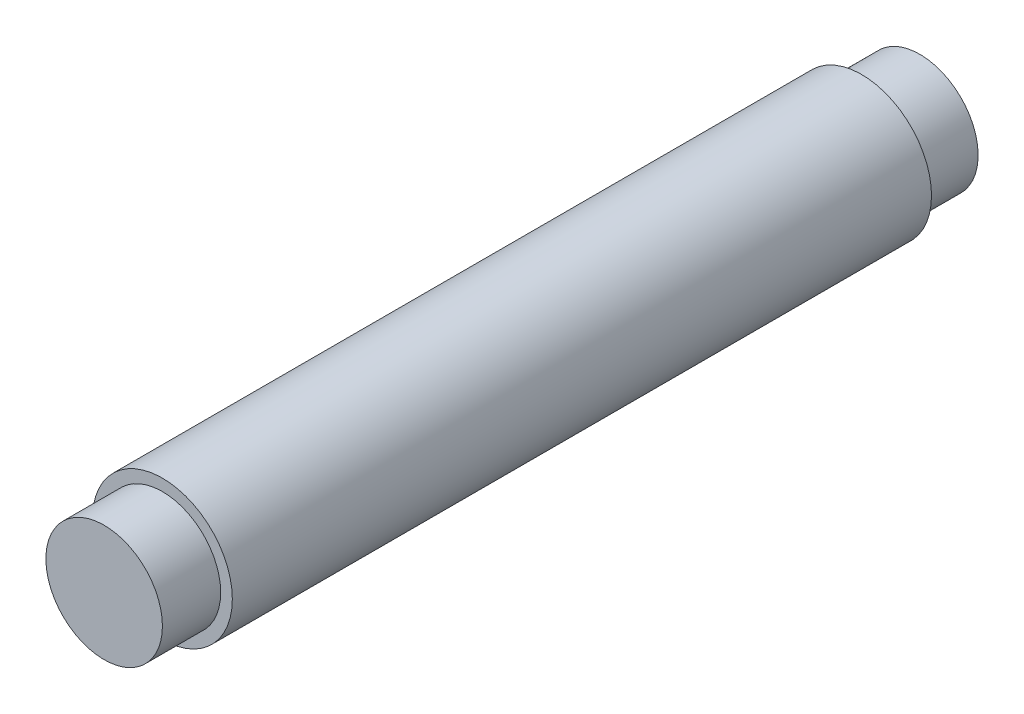
ISO-10303-21;
HEADER;
FILE_DESCRIPTION(('STEP AP214'),'2;1');
FILE_NAME('part.step','',(''),(''),'','','');
FILE_SCHEMA(('AUTOMOTIVE_DESIGN { 1 0 10303 214 1 1 1 1 }'));
ENDSEC;
DATA;
#1=APPLICATION_CONTEXT('core data for automotive mechanical design processes');
#2=APPLICATION_PROTOCOL_DEFINITION('international standard','automotive_design',2000,#1);
#3=PRODUCT_CONTEXT('',#1,'mechanical');
#4=PRODUCT('Part','Part','',(#3));
#5=PRODUCT_RELATED_PRODUCT_CATEGORY('part','',(#4));
#6=PRODUCT_DEFINITION_FORMATION('','',#4);
#7=PRODUCT_DEFINITION_CONTEXT('part definition',#1,'design');
#8=PRODUCT_DEFINITION('design','',#6,#7);
#9=PRODUCT_DEFINITION_SHAPE('','',#8);
#10=(LENGTH_UNIT() NAMED_UNIT(*) SI_UNIT(.MILLI.,.METRE.));
#11=(NAMED_UNIT(*) PLANE_ANGLE_UNIT() SI_UNIT($,.RADIAN.));
#12=(NAMED_UNIT(*) SI_UNIT($,.STERADIAN.) SOLID_ANGLE_UNIT());
#13=UNCERTAINTY_MEASURE_WITH_UNIT(LENGTH_MEASURE(1.E-05),#10,'distance_accuracy_value','');
#14=(GEOMETRIC_REPRESENTATION_CONTEXT(3) GLOBAL_UNCERTAINTY_ASSIGNED_CONTEXT((#13)) GLOBAL_UNIT_ASSIGNED_CONTEXT((#10,
#11,#12)) REPRESENTATION_CONTEXT('',''));
#15=CARTESIAN_POINT('',(0.,0.,0.));
#16=DIRECTION('',(0.,0.,1.));
#17=DIRECTION('',(1.,0.,0.));
#18=AXIS2_PLACEMENT_3D('',#15,#16,#17);
#19=CARTESIAN_POINT('',(0.,0.,60.));
#20=DIRECTION('',(0.,0.,-1.));
#21=DIRECTION('',(-1.,0.,0.));
#22=AXIS2_PLACEMENT_3D('',#19,#20,#21);
#23=CYLINDRICAL_SURFACE('',#22,6.);
#24=CARTESIAN_POINT('',(0.,0.,60.));
#25=DIRECTION('',(0.,0.,1.));
#26=DIRECTION('',(1.,0.,0.));
#27=AXIS2_PLACEMENT_3D('',#24,#25,#26);
#28=CIRCLE('',#27,6.);
#29=CARTESIAN_POINT('',(6.,0.,60.));
#30=VERTEX_POINT('',#29);
#31=EDGE_CURVE('E51',#30,#30,#28,.T.);
#32=ORIENTED_EDGE('',*,*,#31,.F.);
#33=EDGE_LOOP('',(#32));
#34=FACE_BOUND('',#33,.T.);
#35=CARTESIAN_POINT('',(0.,0.,0.));
#36=DIRECTION('',(0.,0.,1.));
#37=DIRECTION('',(1.,0.,0.));
#38=AXIS2_PLACEMENT_3D('',#35,#36,#37);
#39=CIRCLE('',#38,6.);
#40=CARTESIAN_POINT('',(6.,0.,0.));
#41=VERTEX_POINT('',#40);
#42=EDGE_CURVE('E40',#41,#41,#39,.T.);
#43=ORIENTED_EDGE('',*,*,#42,.T.);
#44=EDGE_LOOP('',(#43));
#45=FACE_BOUND('',#44,.T.);
#46=ADVANCED_FACE('F37',(#34,#45),#23,.T.);
#47=CARTESIAN_POINT('',(0.,0.,60.));
#48=DIRECTION('',(0.,0.,1.));
#49=DIRECTION('',(1.,0.,0.));
#50=AXIS2_PLACEMENT_3D('',#47,#48,#49);
#51=PLANE('',#50);
#52=CARTESIAN_POINT('',(0.,0.,60.));
#53=DIRECTION('',(0.,0.,1.));
#54=DIRECTION('',(1.,0.,0.));
#55=AXIS2_PLACEMENT_3D('',#52,#53,#54);
#56=CIRCLE('',#55,5.);
#57=CARTESIAN_POINT('',(5.,0.,60.));
#58=VERTEX_POINT('',#57);
#59=EDGE_CURVE('E45',#58,#58,#56,.T.);
#60=ORIENTED_EDGE('',*,*,#59,.F.);
#61=EDGE_LOOP('',(#60));
#62=FACE_BOUND('',#61,.T.);
#63=ORIENTED_EDGE('',*,*,#31,.T.);
#64=EDGE_LOOP('',(#63));
#65=FACE_BOUND('',#64,.T.);
#66=ADVANCED_FACE('F71',(#62,#65),#51,.T.);
#67=CARTESIAN_POINT('',(0.,0.,0.));
#68=DIRECTION('',(0.,0.,1.));
#69=DIRECTION('',(1.,0.,0.));
#70=AXIS2_PLACEMENT_3D('',#67,#68,#69);
#71=PLANE('',#70);
#72=CARTESIAN_POINT('',(0.,0.,0.));
#73=DIRECTION('',(0.,0.,-1.));
#74=DIRECTION('',(-1.,0.,0.));
#75=AXIS2_PLACEMENT_3D('',#72,#73,#74);
#76=CIRCLE('',#75,5.);
#77=CARTESIAN_POINT('',(-5.,0.,0.));
#78=VERTEX_POINT('',#77);
#79=EDGE_CURVE('E10',#78,#78,#76,.T.);
#80=ORIENTED_EDGE('',*,*,#79,.F.);
#81=EDGE_LOOP('',(#80));
#82=FACE_BOUND('',#81,.T.);
#83=ORIENTED_EDGE('',*,*,#42,.F.);
#84=EDGE_LOOP('',(#83));
#85=FACE_BOUND('',#84,.T.);
#86=ADVANCED_FACE('F68',(#82,#85),#71,.F.);
#87=CARTESIAN_POINT('',(0.,0.,65.));
#88=DIRECTION('',(0.,0.,-1.));
#89=DIRECTION('',(-1.,0.,0.));
#90=AXIS2_PLACEMENT_3D('',#87,#88,#89);
#91=CYLINDRICAL_SURFACE('',#90,5.);
#92=CARTESIAN_POINT('',(0.,0.,65.));
#93=DIRECTION('',(0.,0.,1.));
#94=DIRECTION('',(1.,0.,0.));
#95=AXIS2_PLACEMENT_3D('',#92,#93,#94);
#96=CIRCLE('',#95,5.);
#97=CARTESIAN_POINT('',(5.,0.,65.));
#98=VERTEX_POINT('',#97);
#99=EDGE_CURVE('E56',#98,#98,#96,.T.);
#100=ORIENTED_EDGE('',*,*,#99,.F.);
#101=EDGE_LOOP('',(#100));
#102=FACE_BOUND('',#101,.T.);
#103=ORIENTED_EDGE('',*,*,#59,.T.);
#104=EDGE_LOOP('',(#103));
#105=FACE_BOUND('',#104,.T.);
#106=ADVANCED_FACE('F70',(#102,#105),#91,.T.);
#107=CARTESIAN_POINT('',(0.,0.,65.));
#108=DIRECTION('',(0.,0.,1.));
#109=DIRECTION('',(1.,0.,0.));
#110=AXIS2_PLACEMENT_3D('',#107,#108,#109);
#111=PLANE('',#110);
#112=ORIENTED_EDGE('',*,*,#99,.T.);
#113=EDGE_LOOP('',(#112));
#114=FACE_BOUND('',#113,.T.);
#115=ADVANCED_FACE('F77',(#114),#111,.T.);
#116=CARTESIAN_POINT('',(0.,0.,-5.));
#117=DIRECTION('',(0.,0.,1.));
#118=DIRECTION('',(1.,0.,0.));
#119=AXIS2_PLACEMENT_3D('',#116,#117,#118);
#120=CYLINDRICAL_SURFACE('',#119,5.);
#121=CARTESIAN_POINT('',(0.,0.,-5.));
#122=DIRECTION('',(0.,0.,-1.));
#123=DIRECTION('',(-1.,0.,0.));
#124=AXIS2_PLACEMENT_3D('',#121,#122,#123);
#125=CIRCLE('',#124,5.);
#126=CARTESIAN_POINT('',(-5.,0.,-5.));
#127=VERTEX_POINT('',#126);
#128=EDGE_CURVE('E55',#127,#127,#125,.T.);
#129=ORIENTED_EDGE('',*,*,#128,.F.);
#130=EDGE_LOOP('',(#129));
#131=FACE_BOUND('',#130,.T.);
#132=ORIENTED_EDGE('',*,*,#79,.T.);
#133=EDGE_LOOP('',(#132));
#134=FACE_BOUND('',#133,.T.);
#135=ADVANCED_FACE('F105',(#131,#134),#120,.T.);
#136=CARTESIAN_POINT('',(0.,0.,-5.));
#137=DIRECTION('',(0.,0.,-1.));
#138=DIRECTION('',(-1.,0.,0.));
#139=AXIS2_PLACEMENT_3D('',#136,#137,#138);
#140=PLANE('',#139);
#141=ORIENTED_EDGE('',*,*,#128,.T.);
#142=EDGE_LOOP('',(#141));
#143=FACE_BOUND('',#142,.T.);
#144=ADVANCED_FACE('F119',(#143),#140,.T.);
#145=CLOSED_SHELL('',(#46,#66,#86,#106,#115,#135,#144));
#146=MANIFOLD_SOLID_BREP('B2',#145);
#147=ADVANCED_BREP_SHAPE_REPRESENTATION('',(#18,#146),#14);
#148=SHAPE_DEFINITION_REPRESENTATION(#9,#147);
ENDSEC;
END-ISO-10303-21;
